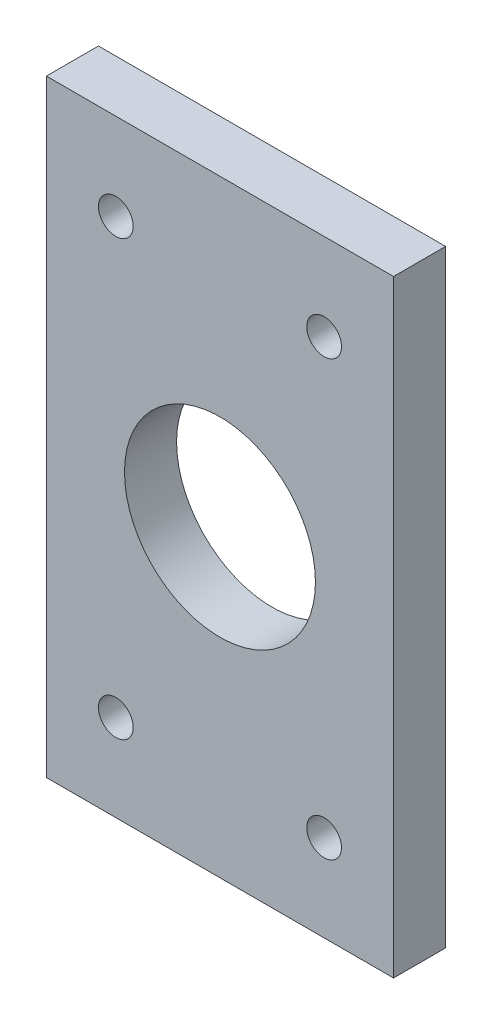
ISO-10303-21;
HEADER;
FILE_DESCRIPTION(('STEP AP214'),'2;1');
FILE_NAME('part.step','',(''),(''),'','','');
FILE_SCHEMA(('AUTOMOTIVE_DESIGN { 1 0 10303 214 1 1 1 1 }'));
ENDSEC;
DATA;
#1=APPLICATION_CONTEXT('core data for automotive mechanical design processes');
#2=APPLICATION_PROTOCOL_DEFINITION('international standard','automotive_design',2000,#1);
#3=PRODUCT_CONTEXT('',#1,'mechanical');
#4=PRODUCT('Part','Part','',(#3));
#5=PRODUCT_RELATED_PRODUCT_CATEGORY('part','',(#4));
#6=PRODUCT_DEFINITION_FORMATION('','',#4);
#7=PRODUCT_DEFINITION_CONTEXT('part definition',#1,'design');
#8=PRODUCT_DEFINITION('design','',#6,#7);
#9=PRODUCT_DEFINITION_SHAPE('','',#8);
#10=(LENGTH_UNIT() NAMED_UNIT(*) SI_UNIT(.MILLI.,.METRE.));
#11=(NAMED_UNIT(*) PLANE_ANGLE_UNIT() SI_UNIT($,.RADIAN.));
#12=(NAMED_UNIT(*) SI_UNIT($,.STERADIAN.) SOLID_ANGLE_UNIT());
#13=UNCERTAINTY_MEASURE_WITH_UNIT(LENGTH_MEASURE(1.E-05),#10,'distance_accuracy_value','');
#14=(GEOMETRIC_REPRESENTATION_CONTEXT(3) GLOBAL_UNCERTAINTY_ASSIGNED_CONTEXT((#13)) GLOBAL_UNIT_ASSIGNED_CONTEXT((#10,
#11,#12)) REPRESENTATION_CONTEXT('',''));
#15=CARTESIAN_POINT('',(0.,0.,0.));
#16=DIRECTION('',(0.,0.,1.));
#17=DIRECTION('',(1.,0.,0.));
#18=AXIS2_PLACEMENT_3D('',#15,#16,#17);
#19=CARTESIAN_POINT('',(0.,0.,6.));
#20=DIRECTION('',(0.,0.,1.));
#21=DIRECTION('',(1.,0.,0.));
#22=AXIS2_PLACEMENT_3D('',#19,#20,#21);
#23=PLANE('',#22);
#24=CARTESIAN_POINT('',(-8.00000000000004,54.5031697770549,6.));
#25=DIRECTION('',(0.,0.,-1.));
#26=DIRECTION('',(1.,0.,0.));
#27=AXIS2_PLACEMENT_3D('',#24,#25,#26);
#28=CIRCLE('',#27,2.);
#29=CARTESIAN_POINT('',(-6.00000000000003,54.5031697770549,6.));
#30=VERTEX_POINT('',#29);
#31=EDGE_CURVE('E146',#30,#30,#28,.T.);
#32=ORIENTED_EDGE('',*,*,#31,.T.);
#33=EDGE_LOOP('',(#32));
#34=FACE_BOUND('',#33,.T.);
#35=CARTESIAN_POINT('',(-32.,54.5031697770549,6.));
#36=DIRECTION('',(0.,0.,-1.));
#37=DIRECTION('',(1.,0.,0.));
#38=AXIS2_PLACEMENT_3D('',#35,#36,#37);
#39=CIRCLE('',#38,2.);
#40=CARTESIAN_POINT('',(-30.,54.5031697770549,6.));
#41=VERTEX_POINT('',#40);
#42=EDGE_CURVE('E136',#41,#41,#39,.T.);
#43=ORIENTED_EDGE('',*,*,#42,.T.);
#44=EDGE_LOOP('',(#43));
#45=FACE_BOUND('',#44,.T.);
#46=CARTESIAN_POINT('',(-8.00000000000004,104.503169777055,6.));
#47=DIRECTION('',(0.,0.,1.));
#48=DIRECTION('',(1.,0.,0.));
#49=AXIS2_PLACEMENT_3D('',#46,#47,#48);
#50=CIRCLE('',#49,2.);
#51=CARTESIAN_POINT('',(-6.00000000000003,104.503169777055,6.));
#52=VERTEX_POINT('',#51);
#53=EDGE_CURVE('E133',#52,#52,#50,.T.);
#54=ORIENTED_EDGE('',*,*,#53,.F.);
#55=EDGE_LOOP('',(#54));
#56=FACE_BOUND('',#55,.T.);
#57=CARTESIAN_POINT('',(-32.,104.503169777055,6.));
#58=DIRECTION('',(0.,0.,1.));
#59=DIRECTION('',(1.,0.,0.));
#60=AXIS2_PLACEMENT_3D('',#57,#58,#59);
#61=CIRCLE('',#60,2.);
#62=CARTESIAN_POINT('',(-30.,104.503169777055,6.));
#63=VERTEX_POINT('',#62);
#64=EDGE_CURVE('E130',#63,#63,#61,.T.);
#65=ORIENTED_EDGE('',*,*,#64,.F.);
#66=EDGE_LOOP('',(#65));
#67=FACE_BOUND('',#66,.T.);
#68=DIRECTION('',(1.,0.,0.));
#69=VECTOR('',#68,1.);
#70=CARTESIAN_POINT('',(-40.,44.503169777055,6.));
#71=LINE('',#70,#69);
#72=CARTESIAN_POINT('',(-40.,44.503169777055,6.));
#73=VERTEX_POINT('',#72);
#74=CARTESIAN_POINT('',(0.,44.503169777055,6.));
#75=VERTEX_POINT('',#74);
#76=EDGE_CURVE('E100',#73,#75,#71,.T.);
#77=ORIENTED_EDGE('',*,*,#76,.T.);
#78=DIRECTION('',(0.,1.,0.));
#79=VECTOR('',#78,1.);
#80=CARTESIAN_POINT('',(0.,44.503169777055,6.));
#81=LINE('',#80,#79);
#82=CARTESIAN_POINT('',(0.,114.503169777055,6.));
#83=VERTEX_POINT('',#82);
#84=EDGE_CURVE('E92',#75,#83,#81,.T.);
#85=ORIENTED_EDGE('',*,*,#84,.T.);
#86=DIRECTION('',(1.,0.,0.));
#87=VECTOR('',#86,1.);
#88=CARTESIAN_POINT('',(-40.,114.503169777055,6.));
#89=LINE('',#88,#87);
#90=CARTESIAN_POINT('',(-40.,114.503169777055,6.));
#91=VERTEX_POINT('',#90);
#92=EDGE_CURVE('E99',#91,#83,#89,.T.);
#93=ORIENTED_EDGE('',*,*,#92,.F.);
#94=DIRECTION('',(0.,1.,0.));
#95=VECTOR('',#94,1.);
#96=CARTESIAN_POINT('',(-40.,44.503169777055,6.));
#97=LINE('',#96,#95);
#98=EDGE_CURVE('E110',#73,#91,#97,.T.);
#99=ORIENTED_EDGE('',*,*,#98,.F.);
#100=EDGE_LOOP('',(#77,#85,#93,#99));
#101=FACE_BOUND('',#100,.T.);
#102=CARTESIAN_POINT('',(-20.,79.503169777055,6.));
#103=DIRECTION('',(0.,0.,1.));
#104=DIRECTION('',(1.,0.,0.));
#105=AXIS2_PLACEMENT_3D('',#102,#103,#104);
#106=CIRCLE('',#105,11.0000000000002);
#107=CARTESIAN_POINT('',(-8.99999999999981,79.503169777055,6.));
#108=VERTEX_POINT('',#107);
#109=EDGE_CURVE('E117',#108,#108,#106,.T.);
#110=ORIENTED_EDGE('',*,*,#109,.F.);
#111=EDGE_LOOP('',(#110));
#112=FACE_BOUND('',#111,.T.);
#113=ADVANCED_FACE('F48',(#34,#45,#56,#67,#101,#112),#23,.T.);
#114=CARTESIAN_POINT('',(0.,0.,0.));
#115=DIRECTION('',(0.,0.,1.));
#116=DIRECTION('',(1.,0.,0.));
#117=AXIS2_PLACEMENT_3D('',#114,#115,#116);
#118=PLANE('',#117);
#119=CARTESIAN_POINT('',(-8.00000000000004,54.5031697770549,0.));
#120=DIRECTION('',(0.,0.,1.));
#121=DIRECTION('',(1.,0.,0.));
#122=AXIS2_PLACEMENT_3D('',#119,#120,#121);
#123=CIRCLE('',#122,2.);
#124=CARTESIAN_POINT('',(-6.00000000000003,54.5031697770549,0.));
#125=VERTEX_POINT('',#124);
#126=EDGE_CURVE('E52',#125,#125,#123,.F.);
#127=ORIENTED_EDGE('',*,*,#126,.F.);
#128=EDGE_LOOP('',(#127));
#129=FACE_BOUND('',#128,.T.);
#130=CARTESIAN_POINT('',(-32.,54.5031697770549,0.));
#131=DIRECTION('',(0.,0.,1.));
#132=DIRECTION('',(1.,0.,0.));
#133=AXIS2_PLACEMENT_3D('',#130,#131,#132);
#134=CIRCLE('',#133,2.);
#135=CARTESIAN_POINT('',(-30.,54.5031697770549,0.));
#136=VERTEX_POINT('',#135);
#137=EDGE_CURVE('E134',#136,#136,#134,.F.);
#138=ORIENTED_EDGE('',*,*,#137,.F.);
#139=EDGE_LOOP('',(#138));
#140=FACE_BOUND('',#139,.T.);
#141=CARTESIAN_POINT('',(-8.00000000000004,104.503169777055,0.));
#142=DIRECTION('',(0.,0.,1.));
#143=DIRECTION('',(1.,0.,0.));
#144=AXIS2_PLACEMENT_3D('',#141,#142,#143);
#145=CIRCLE('',#144,2.);
#146=CARTESIAN_POINT('',(-6.00000000000003,104.503169777055,0.));
#147=VERTEX_POINT('',#146);
#148=EDGE_CURVE('E131',#147,#147,#145,.T.);
#149=ORIENTED_EDGE('',*,*,#148,.T.);
#150=EDGE_LOOP('',(#149));
#151=FACE_BOUND('',#150,.T.);
#152=CARTESIAN_POINT('',(-32.,104.503169777055,0.));
#153=DIRECTION('',(0.,0.,1.));
#154=DIRECTION('',(1.,0.,0.));
#155=AXIS2_PLACEMENT_3D('',#152,#153,#154);
#156=CIRCLE('',#155,2.);
#157=CARTESIAN_POINT('',(-30.,104.503169777055,0.));
#158=VERTEX_POINT('',#157);
#159=EDGE_CURVE('E126',#158,#158,#156,.T.);
#160=ORIENTED_EDGE('',*,*,#159,.T.);
#161=EDGE_LOOP('',(#160));
#162=FACE_BOUND('',#161,.T.);
#163=DIRECTION('',(1.,0.,0.));
#164=VECTOR('',#163,1.);
#165=CARTESIAN_POINT('',(-40.,44.503169777055,0.));
#166=LINE('',#165,#164);
#167=CARTESIAN_POINT('',(-40.,44.503169777055,0.));
#168=VERTEX_POINT('',#167);
#169=CARTESIAN_POINT('',(0.,44.503169777055,0.));
#170=VERTEX_POINT('',#169);
#171=EDGE_CURVE('E115',#168,#170,#166,.T.);
#172=ORIENTED_EDGE('',*,*,#171,.F.);
#173=DIRECTION('',(0.,1.,0.));
#174=VECTOR('',#173,1.);
#175=CARTESIAN_POINT('',(-40.,44.503169777055,0.));
#176=LINE('',#175,#174);
#177=CARTESIAN_POINT('',(-40.,114.503169777055,0.));
#178=VERTEX_POINT('',#177);
#179=EDGE_CURVE('E121',#168,#178,#176,.T.);
#180=ORIENTED_EDGE('',*,*,#179,.T.);
#181=DIRECTION('',(1.,0.,0.));
#182=VECTOR('',#181,1.);
#183=CARTESIAN_POINT('',(-40.,114.503169777055,0.));
#184=LINE('',#183,#182);
#185=CARTESIAN_POINT('',(0.,114.503169777055,0.));
#186=VERTEX_POINT('',#185);
#187=EDGE_CURVE('E119',#178,#186,#184,.T.);
#188=ORIENTED_EDGE('',*,*,#187,.T.);
#189=DIRECTION('',(0.,1.,0.));
#190=VECTOR('',#189,1.);
#191=CARTESIAN_POINT('',(0.,44.503169777055,0.));
#192=LINE('',#191,#190);
#193=EDGE_CURVE('E105',#170,#186,#192,.T.);
#194=ORIENTED_EDGE('',*,*,#193,.F.);
#195=EDGE_LOOP('',(#172,#180,#188,#194));
#196=FACE_BOUND('',#195,.T.);
#197=CARTESIAN_POINT('',(-20.,79.503169777055,0.));
#198=DIRECTION('',(0.,0.,1.));
#199=DIRECTION('',(1.,0.,0.));
#200=AXIS2_PLACEMENT_3D('',#197,#198,#199);
#201=CIRCLE('',#200,11.0000000000002);
#202=CARTESIAN_POINT('',(-8.99999999999981,79.503169777055,0.));
#203=VERTEX_POINT('',#202);
#204=EDGE_CURVE('E129',#203,#203,#201,.T.);
#205=ORIENTED_EDGE('',*,*,#204,.T.);
#206=EDGE_LOOP('',(#205));
#207=FACE_BOUND('',#206,.T.);
#208=ADVANCED_FACE('F156',(#129,#140,#151,#162,#196,#207),#118,.F.);
#209=CARTESIAN_POINT('',(-40.,44.503169777055,6.));
#210=DIRECTION('',(0.,1.,0.));
#211=DIRECTION('',(0.,0.,1.));
#212=AXIS2_PLACEMENT_3D('',#209,#210,#211);
#213=PLANE('',#212);
#214=ORIENTED_EDGE('',*,*,#171,.T.);
#215=DIRECTION('',(0.,0.,-1.));
#216=VECTOR('',#215,1.);
#217=CARTESIAN_POINT('',(0.,44.503169777055,6.));
#218=LINE('',#217,#216);
#219=EDGE_CURVE('E12',#75,#170,#218,.T.);
#220=ORIENTED_EDGE('',*,*,#219,.F.);
#221=ORIENTED_EDGE('',*,*,#76,.F.);
#222=DIRECTION('',(0.,0.,-1.));
#223=VECTOR('',#222,1.);
#224=CARTESIAN_POINT('',(-40.,44.503169777055,6.));
#225=LINE('',#224,#223);
#226=EDGE_CURVE('E67',#73,#168,#225,.T.);
#227=ORIENTED_EDGE('',*,*,#226,.T.);
#228=EDGE_LOOP('',(#214,#220,#221,#227));
#229=FACE_BOUND('',#228,.T.);
#230=ADVANCED_FACE('F50',(#229),#213,.F.);
#231=CARTESIAN_POINT('',(0.,44.503169777055,6.));
#232=DIRECTION('',(-1.,0.,0.));
#233=DIRECTION('',(0.,0.,1.));
#234=AXIS2_PLACEMENT_3D('',#231,#232,#233);
#235=PLANE('',#234);
#236=ORIENTED_EDGE('',*,*,#193,.T.);
#237=DIRECTION('',(0.,0.,-1.));
#238=VECTOR('',#237,1.);
#239=CARTESIAN_POINT('',(0.,114.503169777055,6.));
#240=LINE('',#239,#238);
#241=EDGE_CURVE('E58',#83,#186,#240,.T.);
#242=ORIENTED_EDGE('',*,*,#241,.F.);
#243=ORIENTED_EDGE('',*,*,#84,.F.);
#244=ORIENTED_EDGE('',*,*,#219,.T.);
#245=EDGE_LOOP('',(#236,#242,#243,#244));
#246=FACE_BOUND('',#245,.T.);
#247=ADVANCED_FACE('F104',(#246),#235,.F.);
#248=CARTESIAN_POINT('',(-40.,114.503169777055,6.));
#249=DIRECTION('',(0.,1.,0.));
#250=DIRECTION('',(0.,0.,1.));
#251=AXIS2_PLACEMENT_3D('',#248,#249,#250);
#252=PLANE('',#251);
#253=ORIENTED_EDGE('',*,*,#187,.F.);
#254=DIRECTION('',(0.,0.,-1.));
#255=VECTOR('',#254,1.);
#256=CARTESIAN_POINT('',(-40.,114.503169777055,6.));
#257=LINE('',#256,#255);
#258=EDGE_CURVE('E81',#91,#178,#257,.T.);
#259=ORIENTED_EDGE('',*,*,#258,.F.);
#260=ORIENTED_EDGE('',*,*,#92,.T.);
#261=ORIENTED_EDGE('',*,*,#241,.T.);
#262=EDGE_LOOP('',(#253,#259,#260,#261));
#263=FACE_BOUND('',#262,.T.);
#264=ADVANCED_FACE('F109',(#263),#252,.T.);
#265=CARTESIAN_POINT('',(-40.,44.503169777055,6.));
#266=DIRECTION('',(-1.,0.,0.));
#267=DIRECTION('',(0.,0.,1.));
#268=AXIS2_PLACEMENT_3D('',#265,#266,#267);
#269=PLANE('',#268);
#270=ORIENTED_EDGE('',*,*,#179,.F.);
#271=ORIENTED_EDGE('',*,*,#226,.F.);
#272=ORIENTED_EDGE('',*,*,#98,.T.);
#273=ORIENTED_EDGE('',*,*,#258,.T.);
#274=EDGE_LOOP('',(#270,#271,#272,#273));
#275=FACE_BOUND('',#274,.T.);
#276=ADVANCED_FACE('F161',(#275),#269,.T.);
#277=CARTESIAN_POINT('',(-20.,79.503169777055,6.));
#278=DIRECTION('',(0.,0.,-1.));
#279=DIRECTION('',(-1.,0.,0.));
#280=AXIS2_PLACEMENT_3D('',#277,#278,#279);
#281=CYLINDRICAL_SURFACE('',#280,11.0000000000002);
#282=ORIENTED_EDGE('',*,*,#109,.T.);
#283=EDGE_LOOP('',(#282));
#284=FACE_BOUND('',#283,.T.);
#285=ORIENTED_EDGE('',*,*,#204,.F.);
#286=EDGE_LOOP('',(#285));
#287=FACE_BOUND('',#286,.T.);
#288=ADVANCED_FACE('F158',(#284,#287),#281,.F.);
#289=CARTESIAN_POINT('',(-32.,104.503169777055,-4.));
#290=DIRECTION('',(0.,0.,1.));
#291=DIRECTION('',(1.,0.,0.));
#292=AXIS2_PLACEMENT_3D('',#289,#290,#291);
#293=CYLINDRICAL_SURFACE('',#292,2.);
#294=ORIENTED_EDGE('',*,*,#64,.T.);
#295=EDGE_LOOP('',(#294));
#296=FACE_BOUND('',#295,.T.);
#297=ORIENTED_EDGE('',*,*,#159,.F.);
#298=EDGE_LOOP('',(#297));
#299=FACE_BOUND('',#298,.T.);
#300=ADVANCED_FACE('F160',(#296,#299),#293,.F.);
#301=CARTESIAN_POINT('',(-8.00000000000004,104.503169777055,-4.));
#302=DIRECTION('',(0.,0.,1.));
#303=DIRECTION('',(1.,0.,0.));
#304=AXIS2_PLACEMENT_3D('',#301,#302,#303);
#305=CYLINDRICAL_SURFACE('',#304,2.);
#306=ORIENTED_EDGE('',*,*,#53,.T.);
#307=EDGE_LOOP('',(#306));
#308=FACE_BOUND('',#307,.T.);
#309=ORIENTED_EDGE('',*,*,#148,.F.);
#310=EDGE_LOOP('',(#309));
#311=FACE_BOUND('',#310,.T.);
#312=ADVANCED_FACE('F168',(#308,#311),#305,.F.);
#313=CARTESIAN_POINT('',(-32.,54.5031697770549,-4.));
#314=DIRECTION('',(0.,0.,1.));
#315=DIRECTION('',(1.,0.,0.));
#316=AXIS2_PLACEMENT_3D('',#313,#314,#315);
#317=CYLINDRICAL_SURFACE('',#316,2.);
#318=ORIENTED_EDGE('',*,*,#42,.F.);
#319=EDGE_LOOP('',(#318));
#320=FACE_BOUND('',#319,.T.);
#321=ORIENTED_EDGE('',*,*,#137,.T.);
#322=EDGE_LOOP('',(#321));
#323=FACE_BOUND('',#322,.T.);
#324=ADVANCED_FACE('F202',(#320,#323),#317,.F.);
#325=CARTESIAN_POINT('',(-8.00000000000004,54.5031697770549,-4.));
#326=DIRECTION('',(0.,0.,1.));
#327=DIRECTION('',(1.,0.,0.));
#328=AXIS2_PLACEMENT_3D('',#325,#326,#327);
#329=CYLINDRICAL_SURFACE('',#328,2.);
#330=ORIENTED_EDGE('',*,*,#31,.F.);
#331=EDGE_LOOP('',(#330));
#332=FACE_BOUND('',#331,.T.);
#333=ORIENTED_EDGE('',*,*,#126,.T.);
#334=EDGE_LOOP('',(#333));
#335=FACE_BOUND('',#334,.T.);
#336=ADVANCED_FACE('F207',(#332,#335),#329,.F.);
#337=CLOSED_SHELL('',(#113,#208,#230,#247,#264,#276,#288,#300,#312,#324,#336));
#338=MANIFOLD_SOLID_BREP('B2',#337);
#339=ADVANCED_BREP_SHAPE_REPRESENTATION('',(#18,#338),#14);
#340=SHAPE_DEFINITION_REPRESENTATION(#9,#339);
ENDSEC;
END-ISO-10303-21;
